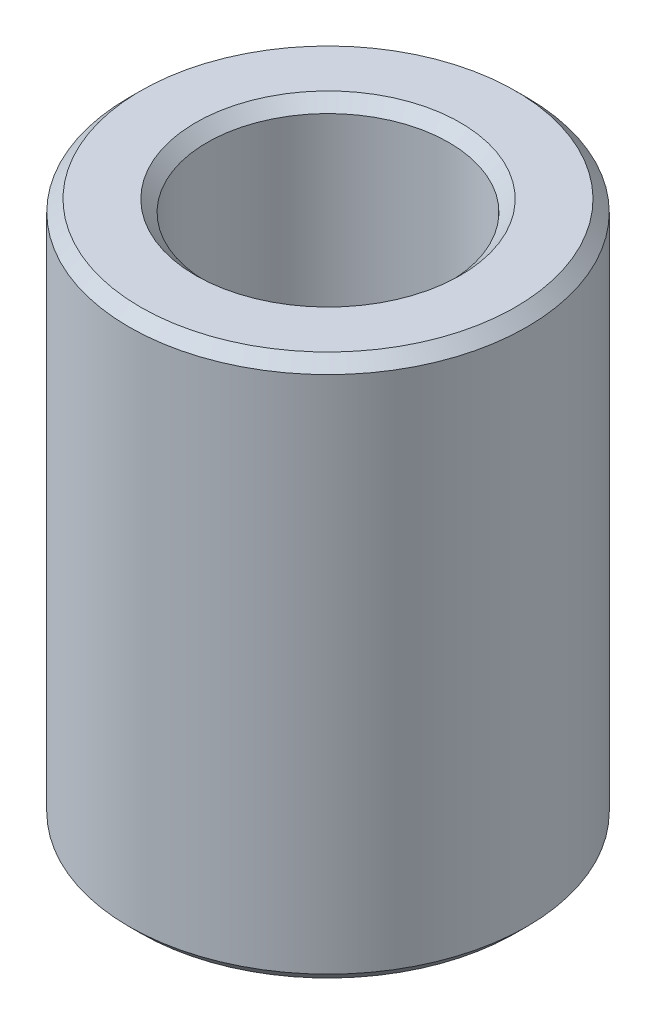
ISO-10303-21;
HEADER;
FILE_DESCRIPTION(('STEP AP214'),'2;1');
FILE_NAME('part.step','',(''),(''),'','','');
FILE_SCHEMA(('AUTOMOTIVE_DESIGN { 1 0 10303 214 1 1 1 1 }'));
ENDSEC;
DATA;
#1=APPLICATION_CONTEXT('core data for automotive mechanical design processes');
#2=APPLICATION_PROTOCOL_DEFINITION('international standard','automotive_design',2000,#1);
#3=PRODUCT_CONTEXT('',#1,'mechanical');
#4=PRODUCT('Part','Part','',(#3));
#5=PRODUCT_RELATED_PRODUCT_CATEGORY('part','',(#4));
#6=PRODUCT_DEFINITION_FORMATION('','',#4);
#7=PRODUCT_DEFINITION_CONTEXT('part definition',#1,'design');
#8=PRODUCT_DEFINITION('design','',#6,#7);
#9=PRODUCT_DEFINITION_SHAPE('','',#8);
#10=(LENGTH_UNIT() NAMED_UNIT(*) SI_UNIT(.MILLI.,.METRE.));
#11=(NAMED_UNIT(*) PLANE_ANGLE_UNIT() SI_UNIT($,.RADIAN.));
#12=(NAMED_UNIT(*) SI_UNIT($,.STERADIAN.) SOLID_ANGLE_UNIT());
#13=UNCERTAINTY_MEASURE_WITH_UNIT(LENGTH_MEASURE(1.E-05),#10,'distance_accuracy_value','');
#14=(GEOMETRIC_REPRESENTATION_CONTEXT(3) GLOBAL_UNCERTAINTY_ASSIGNED_CONTEXT((#13)) GLOBAL_UNIT_ASSIGNED_CONTEXT((#10,
#11,#12)) REPRESENTATION_CONTEXT('',''));
#15=CARTESIAN_POINT('',(0.,0.,0.));
#16=DIRECTION('',(0.,0.,1.));
#17=DIRECTION('',(1.,0.,0.));
#18=AXIS2_PLACEMENT_3D('',#15,#16,#17);
#19=CARTESIAN_POINT('',(0.,143.126735818646,0.));
#20=DIRECTION('',(0.,-1.,0.));
#21=DIRECTION('',(0.,0.,-1.));
#22=AXIS2_PLACEMENT_3D('',#19,#20,#21);
#23=CYLINDRICAL_SURFACE('',#22,52.5);
#24=CARTESIAN_POINT('',(0.,3.0283771481476,0.));
#25=DIRECTION('',(0.,1.,0.));
#26=DIRECTION('',(0.,0.,1.));
#27=AXIS2_PLACEMENT_3D('',#24,#25,#26);
#28=CIRCLE('',#27,52.5);
#29=CARTESIAN_POINT('',(0.,3.0283771481476,52.5));
#30=VERTEX_POINT('',#29);
#31=EDGE_CURVE('E10',#30,#30,#28,.T.);
#32=ORIENTED_EDGE('',*,*,#31,.T.);
#33=EDGE_LOOP('',(#32));
#34=FACE_BOUND('',#33,.T.);
#35=CARTESIAN_POINT('',(0.,140.098358670499,0.));
#36=DIRECTION('',(0.,1.,0.));
#37=DIRECTION('',(0.,0.,1.));
#38=AXIS2_PLACEMENT_3D('',#35,#36,#37);
#39=CIRCLE('',#38,52.5);
#40=CARTESIAN_POINT('',(0.,140.098358670499,52.5));
#41=VERTEX_POINT('',#40);
#42=EDGE_CURVE('E50',#41,#41,#39,.F.);
#43=ORIENTED_EDGE('',*,*,#42,.T.);
#44=EDGE_LOOP('',(#43));
#45=FACE_BOUND('',#44,.T.);
#46=ADVANCED_FACE('F39',(#34,#45),#23,.T.);
#47=CARTESIAN_POINT('',(0.,143.126735818646,0.));
#48=DIRECTION('',(0.,1.,0.));
#49=DIRECTION('',(0.,0.,1.));
#50=AXIS2_PLACEMENT_3D('',#47,#48,#49);
#51=PLANE('',#50);
#52=CARTESIAN_POINT('',(0.,143.126735818646,0.));
#53=DIRECTION('',(0.,1.,0.));
#54=DIRECTION('',(0.,0.,1.));
#55=AXIS2_PLACEMENT_3D('',#52,#53,#54);
#56=CIRCLE('',#55,34.944686693482);
#57=CARTESIAN_POINT('',(0.,143.126735818646,34.944686693482));
#58=VERTEX_POINT('',#57);
#59=EDGE_CURVE('E58',#58,#58,#56,.F.);
#60=ORIENTED_EDGE('',*,*,#59,.T.);
#61=EDGE_LOOP('',(#60));
#62=FACE_BOUND('',#61,.T.);
#63=CARTESIAN_POINT('',(0.,143.126735818646,0.));
#64=DIRECTION('',(0.,1.,0.));
#65=DIRECTION('',(0.,0.,1.));
#66=AXIS2_PLACEMENT_3D('',#63,#64,#65);
#67=CIRCLE('',#66,49.4716228518524);
#68=CARTESIAN_POINT('',(0.,143.126735818646,49.4716228518524));
#69=VERTEX_POINT('',#68);
#70=EDGE_CURVE('E61',#69,#69,#67,.T.);
#71=ORIENTED_EDGE('',*,*,#70,.T.);
#72=EDGE_LOOP('',(#71));
#73=FACE_BOUND('',#72,.T.);
#74=ADVANCED_FACE('F88',(#62,#73),#51,.T.);
#75=CARTESIAN_POINT('',(0.,0.,0.));
#76=DIRECTION('',(0.,1.,0.));
#77=DIRECTION('',(0.,0.,1.));
#78=AXIS2_PLACEMENT_3D('',#75,#76,#77);
#79=PLANE('',#78);
#80=CARTESIAN_POINT('',(0.,0.,0.));
#81=DIRECTION('',(0.,1.,0.));
#82=DIRECTION('',(0.,0.,1.));
#83=AXIS2_PLACEMENT_3D('',#80,#81,#82);
#84=CIRCLE('',#83,34.944686693482);
#85=CARTESIAN_POINT('',(0.,0.,34.944686693482));
#86=VERTEX_POINT('',#85);
#87=EDGE_CURVE('E51',#86,#86,#84,.T.);
#88=ORIENTED_EDGE('',*,*,#87,.T.);
#89=EDGE_LOOP('',(#88));
#90=FACE_BOUND('',#89,.T.);
#91=CARTESIAN_POINT('',(0.,0.,0.));
#92=DIRECTION('',(0.,1.,0.));
#93=DIRECTION('',(0.,0.,1.));
#94=AXIS2_PLACEMENT_3D('',#91,#92,#93);
#95=CIRCLE('',#94,49.4716228518524);
#96=CARTESIAN_POINT('',(0.,0.,49.4716228518524));
#97=VERTEX_POINT('',#96);
#98=EDGE_CURVE('E54',#97,#97,#95,.F.);
#99=ORIENTED_EDGE('',*,*,#98,.T.);
#100=EDGE_LOOP('',(#99));
#101=FACE_BOUND('',#100,.T.);
#102=ADVANCED_FACE('F83',(#90,#101),#79,.F.);
#103=CARTESIAN_POINT('',(0.,143.126735818646,0.));
#104=DIRECTION('',(0.,-1.,0.));
#105=DIRECTION('',(0.,0.,-1.));
#106=AXIS2_PLACEMENT_3D('',#103,#104,#105);
#107=CYLINDRICAL_SURFACE('',#106,31.9163095453344);
#108=CARTESIAN_POINT('',(0.,140.098358670499,0.));
#109=DIRECTION('',(0.,1.,0.));
#110=DIRECTION('',(0.,0.,1.));
#111=AXIS2_PLACEMENT_3D('',#108,#109,#110);
#112=CIRCLE('',#111,31.9163095453344);
#113=CARTESIAN_POINT('',(0.,140.098358670499,31.9163095453344));
#114=VERTEX_POINT('',#113);
#115=EDGE_CURVE('E67',#114,#114,#112,.T.);
#116=ORIENTED_EDGE('',*,*,#115,.T.);
#117=EDGE_LOOP('',(#116));
#118=FACE_BOUND('',#117,.T.);
#119=CARTESIAN_POINT('',(0.,3.0283771481476,0.));
#120=DIRECTION('',(0.,1.,0.));
#121=DIRECTION('',(0.,0.,1.));
#122=AXIS2_PLACEMENT_3D('',#119,#120,#121);
#123=CIRCLE('',#122,31.9163095453344);
#124=CARTESIAN_POINT('',(0.,3.0283771481476,31.9163095453344));
#125=VERTEX_POINT('',#124);
#126=EDGE_CURVE('E69',#125,#125,#123,.F.);
#127=ORIENTED_EDGE('',*,*,#126,.T.);
#128=EDGE_LOOP('',(#127));
#129=FACE_BOUND('',#128,.T.);
#130=ADVANCED_FACE('F71',(#118,#129),#107,.F.);
#131=CARTESIAN_POINT('',(0.,140.098358670499,0.));
#132=DIRECTION('',(0.,1.,0.));
#133=DIRECTION('',(0.,0.,1.));
#134=AXIS2_PLACEMENT_3D('',#131,#132,#133);
#135=CONICAL_SURFACE('',#134,31.9163095453344,0.785398163397447);
#136=ORIENTED_EDGE('',*,*,#59,.F.);
#137=EDGE_LOOP('',(#136));
#138=FACE_BOUND('',#137,.T.);
#139=ORIENTED_EDGE('',*,*,#115,.F.);
#140=EDGE_LOOP('',(#139));
#141=FACE_BOUND('',#140,.T.);
#142=ADVANCED_FACE('F77',(#138,#141),#135,.F.);
#143=CARTESIAN_POINT('',(0.,0.,0.));
#144=DIRECTION('',(0.,-1.,0.));
#145=DIRECTION('',(0.,0.,-1.));
#146=AXIS2_PLACEMENT_3D('',#143,#144,#145);
#147=CONICAL_SURFACE('',#146,34.944686693482,0.785398163397443);
#148=ORIENTED_EDGE('',*,*,#126,.F.);
#149=EDGE_LOOP('',(#148));
#150=FACE_BOUND('',#149,.T.);
#151=ORIENTED_EDGE('',*,*,#87,.F.);
#152=EDGE_LOOP('',(#151));
#153=FACE_BOUND('',#152,.T.);
#154=ADVANCED_FACE('F73',(#150,#153),#147,.F.);
#155=CARTESIAN_POINT('',(0.,3.0283771481476,0.));
#156=DIRECTION('',(0.,1.,0.));
#157=DIRECTION('',(0.,0.,1.));
#158=AXIS2_PLACEMENT_3D('',#155,#156,#157);
#159=CONICAL_SURFACE('',#158,52.5,0.785398163397447);
#160=ORIENTED_EDGE('',*,*,#98,.F.);
#161=EDGE_LOOP('',(#160));
#162=FACE_BOUND('',#161,.T.);
#163=ORIENTED_EDGE('',*,*,#31,.F.);
#164=EDGE_LOOP('',(#163));
#165=FACE_BOUND('',#164,.T.);
#166=ADVANCED_FACE('F76',(#162,#165),#159,.T.);
#167=CARTESIAN_POINT('',(0.,143.126735818646,0.));
#168=DIRECTION('',(0.,-1.,0.));
#169=DIRECTION('',(0.,0.,-1.));
#170=AXIS2_PLACEMENT_3D('',#167,#168,#169);
#171=CONICAL_SURFACE('',#170,49.4716228518524,0.785398163397445);
#172=ORIENTED_EDGE('',*,*,#42,.F.);
#173=EDGE_LOOP('',(#172));
#174=FACE_BOUND('',#173,.T.);
#175=ORIENTED_EDGE('',*,*,#70,.F.);
#176=EDGE_LOOP('',(#175));
#177=FACE_BOUND('',#176,.T.);
#178=ADVANCED_FACE('F45',(#174,#177),#171,.T.);
#179=CLOSED_SHELL('',(#46,#74,#102,#130,#142,#154,#166,#178));
#180=MANIFOLD_SOLID_BREP('B2',#179);
#181=ADVANCED_BREP_SHAPE_REPRESENTATION('',(#18,#180),#14);
#182=SHAPE_DEFINITION_REPRESENTATION(#9,#181);
ENDSEC;
END-ISO-10303-21;
